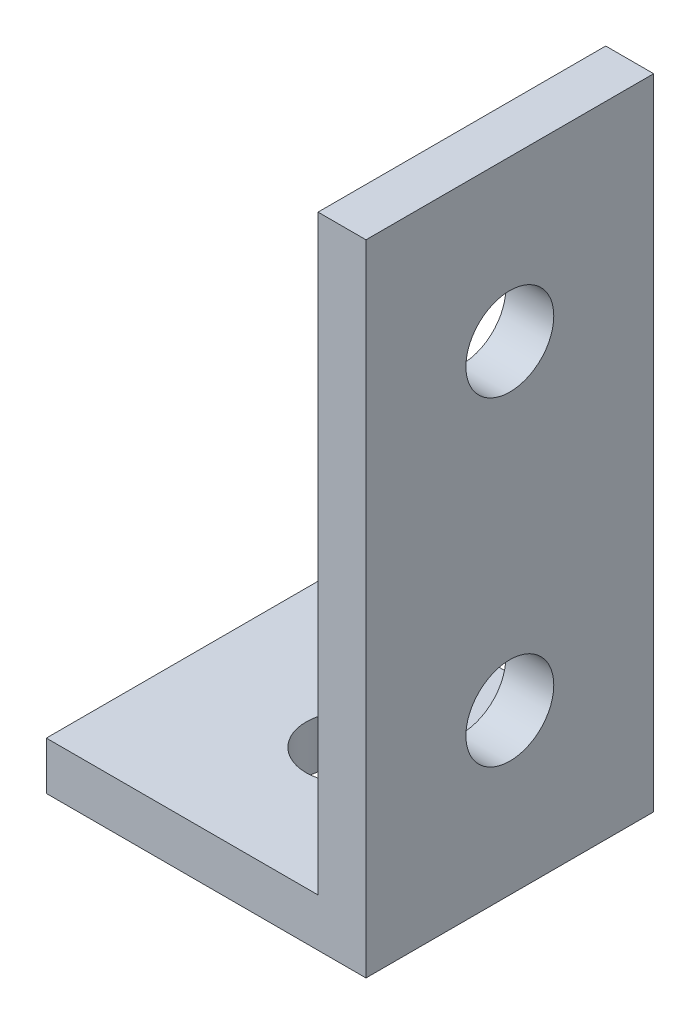
ISO-10303-21;
HEADER;
FILE_DESCRIPTION(('STEP AP214'),'2;1');
FILE_NAME('part.step','',(''),(''),'','','');
FILE_SCHEMA(('AUTOMOTIVE_DESIGN { 1 0 10303 214 1 1 1 1 }'));
ENDSEC;
DATA;
#1=APPLICATION_CONTEXT('core data for automotive mechanical design processes');
#2=APPLICATION_PROTOCOL_DEFINITION('international standard','automotive_design',2000,#1);
#3=PRODUCT_CONTEXT('',#1,'mechanical');
#4=PRODUCT('Part','Part','',(#3));
#5=PRODUCT_RELATED_PRODUCT_CATEGORY('part','',(#4));
#6=PRODUCT_DEFINITION_FORMATION('','',#4);
#7=PRODUCT_DEFINITION_CONTEXT('part definition',#1,'design');
#8=PRODUCT_DEFINITION('design','',#6,#7);
#9=PRODUCT_DEFINITION_SHAPE('','',#8);
#10=(LENGTH_UNIT() NAMED_UNIT(*) SI_UNIT(.MILLI.,.METRE.));
#11=(NAMED_UNIT(*) PLANE_ANGLE_UNIT() SI_UNIT($,.RADIAN.));
#12=(NAMED_UNIT(*) SI_UNIT($,.STERADIAN.) SOLID_ANGLE_UNIT());
#13=UNCERTAINTY_MEASURE_WITH_UNIT(LENGTH_MEASURE(1.E-05),#10,'distance_accuracy_value','');
#14=(GEOMETRIC_REPRESENTATION_CONTEXT(3) GLOBAL_UNCERTAINTY_ASSIGNED_CONTEXT((#13)) GLOBAL_UNIT_ASSIGNED_CONTEXT((#10,
#11,#12)) REPRESENTATION_CONTEXT('',''));
#15=CARTESIAN_POINT('',(0.,0.,0.));
#16=DIRECTION('',(0.,0.,1.));
#17=DIRECTION('',(1.,0.,0.));
#18=AXIS2_PLACEMENT_3D('',#15,#16,#17);
#19=CARTESIAN_POINT('',(-10.,3.,9.));
#20=DIRECTION('',(1.,0.,0.));
#21=DIRECTION('',(0.,0.,-1.));
#22=AXIS2_PLACEMENT_3D('',#19,#20,#21);
#23=PLANE('',#22);
#24=DIRECTION('',(0.,0.,1.));
#25=VECTOR('',#24,1.);
#26=CARTESIAN_POINT('',(-10.,0.,9.));
#27=LINE('',#26,#25);
#28=CARTESIAN_POINT('',(-10.,0.,-9.));
#29=VERTEX_POINT('',#28);
#30=CARTESIAN_POINT('',(-10.,0.,9.));
#31=VERTEX_POINT('',#30);
#32=EDGE_CURVE('E102',#29,#31,#27,.T.);
#33=ORIENTED_EDGE('',*,*,#32,.T.);
#34=DIRECTION('',(0.,-1.,0.));
#35=VECTOR('',#34,1.);
#36=CARTESIAN_POINT('',(-10.,3.,9.));
#37=LINE('',#36,#35);
#38=CARTESIAN_POINT('',(-10.,3.,9.));
#39=VERTEX_POINT('',#38);
#40=EDGE_CURVE('E11',#39,#31,#37,.T.);
#41=ORIENTED_EDGE('',*,*,#40,.F.);
#42=DIRECTION('',(0.,0.,1.));
#43=VECTOR('',#42,1.);
#44=CARTESIAN_POINT('',(-10.,3.,9.));
#45=LINE('',#44,#43);
#46=CARTESIAN_POINT('',(-10.,3.,-9.));
#47=VERTEX_POINT('',#46);
#48=EDGE_CURVE('E96',#47,#39,#45,.T.);
#49=ORIENTED_EDGE('',*,*,#48,.F.);
#50=DIRECTION('',(0.,-1.,0.));
#51=VECTOR('',#50,1.);
#52=CARTESIAN_POINT('',(-10.,3.,-9.));
#53=LINE('',#52,#51);
#54=EDGE_CURVE('E87',#47,#29,#53,.T.);
#55=ORIENTED_EDGE('',*,*,#54,.T.);
#56=EDGE_LOOP('',(#33,#41,#49,#55));
#57=FACE_BOUND('',#56,.T.);
#58=ADVANCED_FACE('F42',(#57),#23,.F.);
#59=CARTESIAN_POINT('',(10.,3.,9.));
#60=DIRECTION('',(0.,0.,-1.));
#61=DIRECTION('',(-1.,0.,0.));
#62=AXIS2_PLACEMENT_3D('',#59,#60,#61);
#63=PLANE('',#62);
#64=DIRECTION('',(1.,0.,0.));
#65=VECTOR('',#64,1.);
#66=CARTESIAN_POINT('',(10.,0.,9.));
#67=LINE('',#66,#65);
#68=CARTESIAN_POINT('',(10.,0.,9.));
#69=VERTEX_POINT('',#68);
#70=EDGE_CURVE('E106',#31,#69,#67,.T.);
#71=ORIENTED_EDGE('',*,*,#70,.T.);
#72=DIRECTION('',(0.,-1.,0.));
#73=VECTOR('',#72,1.);
#74=CARTESIAN_POINT('',(10.,3.,9.));
#75=LINE('',#74,#73);
#76=CARTESIAN_POINT('',(10.,40.,9.));
#77=VERTEX_POINT('',#76);
#78=EDGE_CURVE('E51',#77,#69,#75,.T.);
#79=ORIENTED_EDGE('',*,*,#78,.F.);
#80=DIRECTION('',(1.,0.,0.));
#81=VECTOR('',#80,1.);
#82=CARTESIAN_POINT('',(7.00000000000001,40.,9.));
#83=LINE('',#82,#81);
#84=CARTESIAN_POINT('',(7.00000000000001,40.,9.));
#85=VERTEX_POINT('',#84);
#86=EDGE_CURVE('E151',#85,#77,#83,.T.);
#87=ORIENTED_EDGE('',*,*,#86,.F.);
#88=DIRECTION('',(0.,-1.,0.));
#89=VECTOR('',#88,1.);
#90=CARTESIAN_POINT('',(7.00000000000001,40.,9.));
#91=LINE('',#90,#89);
#92=CARTESIAN_POINT('',(7.00000000000001,3.,9.));
#93=VERTEX_POINT('',#92);
#94=EDGE_CURVE('E114',#85,#93,#91,.T.);
#95=ORIENTED_EDGE('',*,*,#94,.T.);
#96=DIRECTION('',(1.,0.,0.));
#97=VECTOR('',#96,1.);
#98=CARTESIAN_POINT('',(10.,3.,9.));
#99=LINE('',#98,#97);
#100=EDGE_CURVE('E173',#39,#93,#99,.T.);
#101=ORIENTED_EDGE('',*,*,#100,.F.);
#102=ORIENTED_EDGE('',*,*,#40,.T.);
#103=EDGE_LOOP('',(#71,#79,#87,#95,#101,#102));
#104=FACE_BOUND('',#103,.T.);
#105=ADVANCED_FACE('F186',(#104),#63,.F.);
#106=CARTESIAN_POINT('',(10.,3.,9.));
#107=DIRECTION('',(-1.,0.,0.));
#108=DIRECTION('',(0.,0.,1.));
#109=AXIS2_PLACEMENT_3D('',#106,#107,#108);
#110=PLANE('',#109);
#111=CARTESIAN_POINT('',(10.,10.,0.));
#112=DIRECTION('',(1.,0.,0.));
#113=DIRECTION('',(0.,0.,-1.));
#114=AXIS2_PLACEMENT_3D('',#111,#112,#113);
#115=CIRCLE('',#114,2.75);
#116=CARTESIAN_POINT('',(10.,10.,-2.75));
#117=VERTEX_POINT('',#116);
#118=EDGE_CURVE('E128',#117,#117,#115,.T.);
#119=ORIENTED_EDGE('',*,*,#118,.F.);
#120=EDGE_LOOP('',(#119));
#121=FACE_BOUND('',#120,.T.);
#122=CARTESIAN_POINT('',(10.,30.,0.));
#123=DIRECTION('',(1.,0.,0.));
#124=DIRECTION('',(0.,0.,-1.));
#125=AXIS2_PLACEMENT_3D('',#122,#123,#124);
#126=CIRCLE('',#125,2.75);
#127=CARTESIAN_POINT('',(10.,30.,-2.75));
#128=VERTEX_POINT('',#127);
#129=EDGE_CURVE('E136',#128,#128,#126,.T.);
#130=ORIENTED_EDGE('',*,*,#129,.F.);
#131=EDGE_LOOP('',(#130));
#132=FACE_BOUND('',#131,.T.);
#133=DIRECTION('',(0.,0.,-1.));
#134=VECTOR('',#133,1.);
#135=CARTESIAN_POINT('',(10.,0.,9.));
#136=LINE('',#135,#134);
#137=CARTESIAN_POINT('',(10.,0.,-9.));
#138=VERTEX_POINT('',#137);
#139=EDGE_CURVE('E97',#69,#138,#136,.T.);
#140=ORIENTED_EDGE('',*,*,#139,.T.);
#141=DIRECTION('',(0.,-1.,0.));
#142=VECTOR('',#141,1.);
#143=CARTESIAN_POINT('',(10.,3.,-9.));
#144=LINE('',#143,#142);
#145=CARTESIAN_POINT('',(10.,40.,-9.));
#146=VERTEX_POINT('',#145);
#147=EDGE_CURVE('E91',#146,#138,#144,.T.);
#148=ORIENTED_EDGE('',*,*,#147,.F.);
#149=DIRECTION('',(0.,0.,-1.));
#150=VECTOR('',#149,1.);
#151=CARTESIAN_POINT('',(10.,40.,9.));
#152=LINE('',#151,#150);
#153=EDGE_CURVE('E155',#77,#146,#152,.T.);
#154=ORIENTED_EDGE('',*,*,#153,.F.);
#155=ORIENTED_EDGE('',*,*,#78,.T.);
#156=EDGE_LOOP('',(#140,#148,#154,#155));
#157=FACE_BOUND('',#156,.T.);
#158=ADVANCED_FACE('F198',(#121,#132,#157),#110,.F.);
#159=CARTESIAN_POINT('',(10.,3.,-9.));
#160=DIRECTION('',(0.,0.,1.));
#161=DIRECTION('',(1.,0.,0.));
#162=AXIS2_PLACEMENT_3D('',#159,#160,#161);
#163=PLANE('',#162);
#164=DIRECTION('',(-1.,0.,0.));
#165=VECTOR('',#164,1.);
#166=CARTESIAN_POINT('',(10.,0.,-9.));
#167=LINE('',#166,#165);
#168=EDGE_CURVE('E84',#138,#29,#167,.T.);
#169=ORIENTED_EDGE('',*,*,#168,.T.);
#170=ORIENTED_EDGE('',*,*,#54,.F.);
#171=DIRECTION('',(-1.,0.,0.));
#172=VECTOR('',#171,1.);
#173=CARTESIAN_POINT('',(10.,3.,-9.));
#174=LINE('',#173,#172);
#175=CARTESIAN_POINT('',(7.,3.,-9.));
#176=VERTEX_POINT('',#175);
#177=EDGE_CURVE('E64',#176,#47,#174,.T.);
#178=ORIENTED_EDGE('',*,*,#177,.F.);
#179=DIRECTION('',(0.,-1.,0.));
#180=VECTOR('',#179,1.);
#181=CARTESIAN_POINT('',(7.,40.,-9.));
#182=LINE('',#181,#180);
#183=CARTESIAN_POINT('',(7.,40.,-9.));
#184=VERTEX_POINT('',#183);
#185=EDGE_CURVE('E108',#184,#176,#182,.T.);
#186=ORIENTED_EDGE('',*,*,#185,.F.);
#187=DIRECTION('',(-1.,0.,0.));
#188=VECTOR('',#187,1.);
#189=CARTESIAN_POINT('',(10.,40.,-9.));
#190=LINE('',#189,#188);
#191=EDGE_CURVE('E159',#146,#184,#190,.T.);
#192=ORIENTED_EDGE('',*,*,#191,.F.);
#193=ORIENTED_EDGE('',*,*,#147,.T.);
#194=EDGE_LOOP('',(#169,#170,#178,#186,#192,#193));
#195=FACE_BOUND('',#194,.T.);
#196=ADVANCED_FACE('F86',(#195),#163,.F.);
#197=CARTESIAN_POINT('',(0.,3.,0.));
#198=DIRECTION('',(0.,1.,0.));
#199=DIRECTION('',(0.,0.,1.));
#200=AXIS2_PLACEMENT_3D('',#197,#198,#199);
#201=PLANE('',#200);
#202=CARTESIAN_POINT('',(0.,3.,0.));
#203=DIRECTION('',(0.,1.,0.));
#204=DIRECTION('',(0.,0.,1.));
#205=AXIS2_PLACEMENT_3D('',#202,#203,#204);
#206=CIRCLE('',#205,2.75);
#207=CARTESIAN_POINT('',(0.,3.,2.75));
#208=VERTEX_POINT('',#207);
#209=EDGE_CURVE('E147',#208,#208,#206,.T.);
#210=ORIENTED_EDGE('',*,*,#209,.F.);
#211=EDGE_LOOP('',(#210));
#212=FACE_BOUND('',#211,.T.);
#213=DIRECTION('',(0.,0.,1.));
#214=VECTOR('',#213,1.);
#215=CARTESIAN_POINT('',(7.,3.,-9.));
#216=LINE('',#215,#214);
#217=EDGE_CURVE('E59',#176,#93,#216,.T.);
#218=ORIENTED_EDGE('',*,*,#217,.F.);
#219=ORIENTED_EDGE('',*,*,#177,.T.);
#220=ORIENTED_EDGE('',*,*,#48,.T.);
#221=ORIENTED_EDGE('',*,*,#100,.T.);
#222=EDGE_LOOP('',(#218,#219,#220,#221));
#223=FACE_BOUND('',#222,.T.);
#224=ADVANCED_FACE('F177',(#212,#223),#201,.T.);
#225=CARTESIAN_POINT('',(0.,0.,0.));
#226=DIRECTION('',(0.,1.,0.));
#227=DIRECTION('',(0.,0.,1.));
#228=AXIS2_PLACEMENT_3D('',#225,#226,#227);
#229=PLANE('',#228);
#230=CARTESIAN_POINT('',(0.,0.,0.));
#231=DIRECTION('',(0.,-1.,0.));
#232=DIRECTION('',(0.,0.,-1.));
#233=AXIS2_PLACEMENT_3D('',#230,#231,#232);
#234=CIRCLE('',#233,2.75);
#235=CARTESIAN_POINT('',(0.,0.,-2.75));
#236=VERTEX_POINT('',#235);
#237=EDGE_CURVE('E134',#236,#236,#234,.T.);
#238=ORIENTED_EDGE('',*,*,#237,.F.);
#239=EDGE_LOOP('',(#238));
#240=FACE_BOUND('',#239,.T.);
#241=ORIENTED_EDGE('',*,*,#32,.F.);
#242=ORIENTED_EDGE('',*,*,#168,.F.);
#243=ORIENTED_EDGE('',*,*,#139,.F.);
#244=ORIENTED_EDGE('',*,*,#70,.F.);
#245=EDGE_LOOP('',(#241,#242,#243,#244));
#246=FACE_BOUND('',#245,.T.);
#247=ADVANCED_FACE('F105',(#240,#246),#229,.F.);
#248=CARTESIAN_POINT('',(7.,40.,-9.));
#249=DIRECTION('',(1.,0.,0.));
#250=DIRECTION('',(0.,0.,-1.));
#251=AXIS2_PLACEMENT_3D('',#248,#249,#250);
#252=PLANE('',#251);
#253=CARTESIAN_POINT('',(7.00000000000001,10.,0.));
#254=DIRECTION('',(1.,0.,0.));
#255=DIRECTION('',(0.,0.,-1.));
#256=AXIS2_PLACEMENT_3D('',#253,#254,#255);
#257=CIRCLE('',#256,2.75);
#258=CARTESIAN_POINT('',(7.00000000000001,10.,-2.75));
#259=VERTEX_POINT('',#258);
#260=EDGE_CURVE('E45',#259,#259,#257,.T.);
#261=ORIENTED_EDGE('',*,*,#260,.T.);
#262=EDGE_LOOP('',(#261));
#263=FACE_BOUND('',#262,.T.);
#264=CARTESIAN_POINT('',(7.00000000000001,30.,0.));
#265=DIRECTION('',(1.,0.,0.));
#266=DIRECTION('',(0.,0.,-1.));
#267=AXIS2_PLACEMENT_3D('',#264,#265,#266);
#268=CIRCLE('',#267,2.75);
#269=CARTESIAN_POINT('',(7.00000000000001,30.,-2.75));
#270=VERTEX_POINT('',#269);
#271=EDGE_CURVE('E125',#270,#270,#268,.T.);
#272=ORIENTED_EDGE('',*,*,#271,.T.);
#273=EDGE_LOOP('',(#272));
#274=FACE_BOUND('',#273,.T.);
#275=ORIENTED_EDGE('',*,*,#217,.T.);
#276=ORIENTED_EDGE('',*,*,#94,.F.);
#277=DIRECTION('',(0.,0.,1.));
#278=VECTOR('',#277,1.);
#279=CARTESIAN_POINT('',(7.,40.,-9.));
#280=LINE('',#279,#278);
#281=EDGE_CURVE('E163',#184,#85,#280,.T.);
#282=ORIENTED_EDGE('',*,*,#281,.F.);
#283=ORIENTED_EDGE('',*,*,#185,.T.);
#284=EDGE_LOOP('',(#275,#276,#282,#283));
#285=FACE_BOUND('',#284,.T.);
#286=ADVANCED_FACE('F182',(#263,#274,#285),#252,.F.);
#287=CARTESIAN_POINT('',(0.,40.,0.));
#288=DIRECTION('',(0.,1.,0.));
#289=DIRECTION('',(0.,0.,1.));
#290=AXIS2_PLACEMENT_3D('',#287,#288,#289);
#291=PLANE('',#290);
#292=ORIENTED_EDGE('',*,*,#86,.T.);
#293=ORIENTED_EDGE('',*,*,#153,.T.);
#294=ORIENTED_EDGE('',*,*,#191,.T.);
#295=ORIENTED_EDGE('',*,*,#281,.T.);
#296=EDGE_LOOP('',(#292,#293,#294,#295));
#297=FACE_BOUND('',#296,.T.);
#298=ADVANCED_FACE('F192',(#297),#291,.T.);
#299=CARTESIAN_POINT('',(0.,40.,0.));
#300=DIRECTION('',(0.,-1.,0.));
#301=DIRECTION('',(0.,0.,-1.));
#302=AXIS2_PLACEMENT_3D('',#299,#300,#301);
#303=CYLINDRICAL_SURFACE('',#302,2.75);
#304=ORIENTED_EDGE('',*,*,#209,.T.);
#305=EDGE_LOOP('',(#304));
#306=FACE_BOUND('',#305,.T.);
#307=ORIENTED_EDGE('',*,*,#237,.T.);
#308=EDGE_LOOP('',(#307));
#309=FACE_BOUND('',#308,.T.);
#310=ADVANCED_FACE('F236',(#306,#309),#303,.F.);
#311=CARTESIAN_POINT('',(-10.,30.,0.));
#312=DIRECTION('',(1.,0.,0.));
#313=DIRECTION('',(0.,0.,-1.));
#314=AXIS2_PLACEMENT_3D('',#311,#312,#313);
#315=CYLINDRICAL_SURFACE('',#314,2.75);
#316=ORIENTED_EDGE('',*,*,#129,.T.);
#317=EDGE_LOOP('',(#316));
#318=FACE_BOUND('',#317,.T.);
#319=ORIENTED_EDGE('',*,*,#271,.F.);
#320=EDGE_LOOP('',(#319));
#321=FACE_BOUND('',#320,.T.);
#322=ADVANCED_FACE('F264',(#318,#321),#315,.F.);
#323=CARTESIAN_POINT('',(-10.,10.,0.));
#324=DIRECTION('',(1.,0.,0.));
#325=DIRECTION('',(0.,0.,-1.));
#326=AXIS2_PLACEMENT_3D('',#323,#324,#325);
#327=CYLINDRICAL_SURFACE('',#326,2.75);
#328=ORIENTED_EDGE('',*,*,#118,.T.);
#329=EDGE_LOOP('',(#328));
#330=FACE_BOUND('',#329,.T.);
#331=ORIENTED_EDGE('',*,*,#260,.F.);
#332=EDGE_LOOP('',(#331));
#333=FACE_BOUND('',#332,.T.);
#334=ADVANCED_FACE('F288',(#330,#333),#327,.F.);
#335=CLOSED_SHELL('',(#58,#105,#158,#196,#224,#247,#286,#298,#310,#322,#334));
#336=MANIFOLD_SOLID_BREP('B2',#335);
#337=ADVANCED_BREP_SHAPE_REPRESENTATION('',(#18,#336),#14);
#338=SHAPE_DEFINITION_REPRESENTATION(#9,#337);
ENDSEC;
END-ISO-10303-21;
